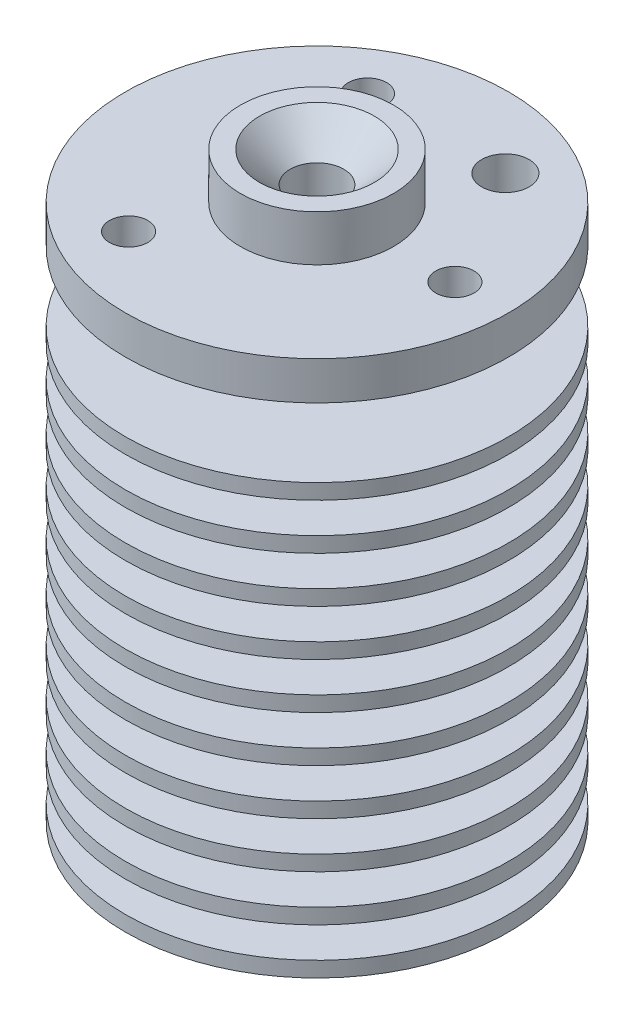
ISO-10303-21;
HEADER;
FILE_DESCRIPTION(('STEP AP214'),'2;1');
FILE_NAME('part.step','',(''),(''),'','','');
FILE_SCHEMA(('AUTOMOTIVE_DESIGN { 1 0 10303 214 1 1 1 1 }'));
ENDSEC;
DATA;
#1=APPLICATION_CONTEXT('core data for automotive mechanical design processes');
#2=APPLICATION_PROTOCOL_DEFINITION('international standard','automotive_design',2000,#1);
#3=PRODUCT_CONTEXT('',#1,'mechanical');
#4=PRODUCT('Part','Part','',(#3));
#5=PRODUCT_RELATED_PRODUCT_CATEGORY('part','',(#4));
#6=PRODUCT_DEFINITION_FORMATION('','',#4);
#7=PRODUCT_DEFINITION_CONTEXT('part definition',#1,'design');
#8=PRODUCT_DEFINITION('design','',#6,#7);
#9=PRODUCT_DEFINITION_SHAPE('','',#8);
#10=(LENGTH_UNIT() NAMED_UNIT(*) SI_UNIT(.MILLI.,.METRE.));
#11=(NAMED_UNIT(*) PLANE_ANGLE_UNIT() SI_UNIT($,.RADIAN.));
#12=(NAMED_UNIT(*) SI_UNIT($,.STERADIAN.) SOLID_ANGLE_UNIT());
#13=UNCERTAINTY_MEASURE_WITH_UNIT(LENGTH_MEASURE(1.E-05),#10,'distance_accuracy_value','');
#14=(GEOMETRIC_REPRESENTATION_CONTEXT(3) GLOBAL_UNCERTAINTY_ASSIGNED_CONTEXT((#13)) GLOBAL_UNIT_ASSIGNED_CONTEXT((#10,
#11,#12)) REPRESENTATION_CONTEXT('',''));
#15=CARTESIAN_POINT('',(0.,0.,0.));
#16=DIRECTION('',(0.,0.,1.));
#17=DIRECTION('',(1.,0.,0.));
#18=AXIS2_PLACEMENT_3D('',#15,#16,#17);
#19=CARTESIAN_POINT('',(0.,9.99999999999999,-12.5));
#20=DIRECTION('',(0.,-1.,0.));
#21=DIRECTION('',(0.,0.,-1.));
#22=AXIS2_PLACEMENT_3D('',#19,#20,#21);
#23=PLANE('',#22);
#24=CARTESIAN_POINT('',(0.,9.99999999999999,0.));
#25=DIRECTION('',(0.,1.,0.));
#26=DIRECTION('',(0.,0.,1.));
#27=AXIS2_PLACEMENT_3D('',#24,#25,#26);
#28=CIRCLE('',#27,12.5);
#29=CARTESIAN_POINT('',(0.,9.99999999999999,12.5));
#30=VERTEX_POINT('',#29);
#31=EDGE_CURVE('E98',#30,#30,#28,.T.);
#32=ORIENTED_EDGE('',*,*,#31,.F.);
#33=EDGE_LOOP('',(#32));
#34=FACE_BOUND('',#33,.T.);
#35=CARTESIAN_POINT('',(0.,9.99999999999999,0.));
#36=DIRECTION('',(0.,-1.,0.));
#37=DIRECTION('',(0.,0.,-1.));
#38=AXIS2_PLACEMENT_3D('',#35,#36,#37);
#39=CIRCLE('',#38,5.);
#40=CARTESIAN_POINT('',(0.,9.99999999999999,-5.));
#41=VERTEX_POINT('',#40);
#42=EDGE_CURVE('E364',#41,#41,#39,.T.);
#43=ORIENTED_EDGE('',*,*,#42,.F.);
#44=EDGE_LOOP('',(#43));
#45=FACE_BOUND('',#44,.T.);
#46=ADVANCED_FACE('F34',(#34,#45),#23,.T.);
#47=CARTESIAN_POINT('',(0.,1.99999999999999,-3.5));
#48=DIRECTION('',(0.,1.,0.));
#49=DIRECTION('',(0.,0.,1.));
#50=AXIS2_PLACEMENT_3D('',#47,#48,#49);
#51=PLANE('',#50);
#52=CARTESIAN_POINT('',(0.,1.99999999999999,0.));
#53=DIRECTION('',(0.,1.,0.));
#54=DIRECTION('',(0.,0.,1.));
#55=AXIS2_PLACEMENT_3D('',#52,#53,#54);
#56=CIRCLE('',#55,12.5);
#57=CARTESIAN_POINT('',(0.,1.99999999999999,12.5));
#58=VERTEX_POINT('',#57);
#59=EDGE_CURVE('E83',#58,#58,#56,.T.);
#60=ORIENTED_EDGE('',*,*,#59,.T.);
#61=EDGE_LOOP('',(#60));
#62=FACE_BOUND('',#61,.T.);
#63=CARTESIAN_POINT('',(0.,1.99999999999999,0.));
#64=DIRECTION('',(0.,1.,0.));
#65=DIRECTION('',(0.,0.,1.));
#66=AXIS2_PLACEMENT_3D('',#63,#64,#65);
#67=CIRCLE('',#66,5.);
#68=CARTESIAN_POINT('',(0.,1.99999999999999,5.));
#69=VERTEX_POINT('',#68);
#70=EDGE_CURVE('E363',#69,#69,#67,.T.);
#71=ORIENTED_EDGE('',*,*,#70,.F.);
#72=EDGE_LOOP('',(#71));
#73=FACE_BOUND('',#72,.T.);
#74=ADVANCED_FACE('F209',(#62,#73),#51,.T.);
#75=CARTESIAN_POINT('',(0.,0.,0.));
#76=DIRECTION('',(0.,-1.,0.));
#77=DIRECTION('',(0.,0.,-1.));
#78=AXIS2_PLACEMENT_3D('',#75,#76,#77);
#79=CYLINDRICAL_SURFACE('',#78,12.5);
#80=ORIENTED_EDGE('',*,*,#59,.F.);
#81=EDGE_LOOP('',(#80));
#82=FACE_BOUND('',#81,.T.);
#83=CARTESIAN_POINT('',(0.,1.,0.));
#84=DIRECTION('',(0.,-1.,0.));
#85=DIRECTION('',(0.,0.,-1.));
#86=AXIS2_PLACEMENT_3D('',#83,#84,#85);
#87=CIRCLE('',#86,12.5);
#88=CARTESIAN_POINT('',(0.,1.,-12.5));
#89=VERTEX_POINT('',#88);
#90=EDGE_CURVE('E56',#89,#89,#87,.T.);
#91=ORIENTED_EDGE('',*,*,#90,.F.);
#92=EDGE_LOOP('',(#91));
#93=FACE_BOUND('',#92,.T.);
#94=ADVANCED_FACE('F203',(#82,#93),#79,.T.);
#95=CARTESIAN_POINT('',(0.,0.,0.));
#96=DIRECTION('',(0.,-1.,0.));
#97=DIRECTION('',(0.,0.,-1.));
#98=AXIS2_PLACEMENT_3D('',#95,#96,#97);
#99=CYLINDRICAL_SURFACE('',#98,2.5);
#100=CARTESIAN_POINT('',(0.,8.,0.));
#101=DIRECTION('',(0.,-1.,0.));
#102=DIRECTION('',(0.,0.,-1.));
#103=AXIS2_PLACEMENT_3D('',#100,#101,#102);
#104=CIRCLE('',#103,2.5);
#105=CARTESIAN_POINT('',(0.,8.,-2.5));
#106=VERTEX_POINT('',#105);
#107=EDGE_CURVE('E182',#106,#106,#104,.T.);
#108=ORIENTED_EDGE('',*,*,#107,.F.);
#109=EDGE_LOOP('',(#108));
#110=FACE_BOUND('',#109,.T.);
#111=CARTESIAN_POINT('',(0.,1.,0.));
#112=DIRECTION('',(0.,-1.,0.));
#113=DIRECTION('',(0.,0.,-1.));
#114=AXIS2_PLACEMENT_3D('',#111,#112,#113);
#115=CIRCLE('',#114,2.5);
#116=CARTESIAN_POINT('',(0.,1.,-2.5));
#117=VERTEX_POINT('',#116);
#118=EDGE_CURVE('E53',#117,#117,#115,.F.);
#119=ORIENTED_EDGE('',*,*,#118,.F.);
#120=EDGE_LOOP('',(#119));
#121=FACE_BOUND('',#120,.T.);
#122=ADVANCED_FACE('F192',(#110,#121),#99,.F.);
#123=CARTESIAN_POINT('',(-0.8,36.,0.));
#124=DIRECTION('',(0.,-1.,0.));
#125=DIRECTION('',(0.,0.,-1.));
#126=AXIS2_PLACEMENT_3D('',#123,#124,#125);
#127=PLANE('',#126);
#128=CARTESIAN_POINT('',(4.49999999999998,36.,-7.79422863405996));
#129=DIRECTION('',(0.,1.,0.));
#130=DIRECTION('',(0.,0.,1.));
#131=AXIS2_PLACEMENT_3D('',#128,#129,#130);
#132=CIRCLE('',#131,1.55);
#133=CARTESIAN_POINT('',(4.49999999999998,36.,-6.24422863405996));
#134=VERTEX_POINT('',#133);
#135=EDGE_CURVE('E384',#134,#134,#132,.T.);
#136=ORIENTED_EDGE('',*,*,#135,.F.);
#137=EDGE_LOOP('',(#136));
#138=FACE_BOUND('',#137,.T.);
#139=CARTESIAN_POINT('',(-4.5,36.,-7.79422863405995));
#140=DIRECTION('',(0.,1.,0.));
#141=DIRECTION('',(0.,0.,1.));
#142=AXIS2_PLACEMENT_3D('',#139,#140,#141);
#143=CIRCLE('',#142,1.25);
#144=CARTESIAN_POINT('',(-4.5,36.,-6.54422863405995));
#145=VERTEX_POINT('',#144);
#146=EDGE_CURVE('E55',#145,#145,#143,.T.);
#147=ORIENTED_EDGE('',*,*,#146,.F.);
#148=EDGE_LOOP('',(#147));
#149=FACE_BOUND('',#148,.T.);
#150=CARTESIAN_POINT('',(-4.5,36.,7.79422863405995));
#151=DIRECTION('',(0.,1.,0.));
#152=DIRECTION('',(0.,0.,1.));
#153=AXIS2_PLACEMENT_3D('',#150,#151,#152);
#154=CIRCLE('',#153,1.25);
#155=CARTESIAN_POINT('',(-4.5,36.,9.04422863405995));
#156=VERTEX_POINT('',#155);
#157=EDGE_CURVE('E60',#156,#156,#154,.T.);
#158=ORIENTED_EDGE('',*,*,#157,.F.);
#159=EDGE_LOOP('',(#158));
#160=FACE_BOUND('',#159,.T.);
#161=CARTESIAN_POINT('',(9.,36.,0.));
#162=DIRECTION('',(0.,1.,0.));
#163=DIRECTION('',(0.,0.,1.));
#164=AXIS2_PLACEMENT_3D('',#161,#162,#163);
#165=CIRCLE('',#164,1.25);
#166=CARTESIAN_POINT('',(9.,36.,1.25));
#167=VERTEX_POINT('',#166);
#168=EDGE_CURVE('E74',#167,#167,#165,.T.);
#169=ORIENTED_EDGE('',*,*,#168,.F.);
#170=EDGE_LOOP('',(#169));
#171=FACE_BOUND('',#170,.T.);
#172=CARTESIAN_POINT('',(0.,36.,0.));
#173=DIRECTION('',(0.,-1.,0.));
#174=DIRECTION('',(0.,0.,-1.));
#175=AXIS2_PLACEMENT_3D('',#172,#173,#174);
#176=CIRCLE('',#175,12.5);
#177=CARTESIAN_POINT('',(0.,36.,-12.5));
#178=VERTEX_POINT('',#177);
#179=EDGE_CURVE('E179',#178,#178,#176,.T.);
#180=ORIENTED_EDGE('',*,*,#179,.F.);
#181=EDGE_LOOP('',(#180));
#182=FACE_BOUND('',#181,.T.);
#183=CARTESIAN_POINT('',(0.,36.,0.));
#184=DIRECTION('',(0.,-1.,0.));
#185=DIRECTION('',(0.,0.,-1.));
#186=AXIS2_PLACEMENT_3D('',#183,#184,#185);
#187=CIRCLE('',#186,5.);
#188=CARTESIAN_POINT('',(0.,36.,-5.));
#189=VERTEX_POINT('',#188);
#190=EDGE_CURVE('E50',#189,#189,#187,.F.);
#191=ORIENTED_EDGE('',*,*,#190,.F.);
#192=EDGE_LOOP('',(#191));
#193=FACE_BOUND('',#192,.T.);
#194=ADVANCED_FACE('F189',(#138,#149,#160,#171,#182,#193),#127,.F.);
#195=CARTESIAN_POINT('',(0.,11.,0.));
#196=DIRECTION('',(0.,1.,0.));
#197=DIRECTION('',(0.,0.,1.));
#198=AXIS2_PLACEMENT_3D('',#195,#196,#197);
#199=CIRCLE('',#198,12.5);
#200=CARTESIAN_POINT('',(0.,11.,12.5));
#201=VERTEX_POINT('',#200);
#202=EDGE_CURVE('E101',#201,#201,#199,.T.);
#203=ORIENTED_EDGE('',*,*,#202,.F.);
#204=EDGE_LOOP('',(#203));
#205=FACE_BOUND('',#204,.T.);
#206=ORIENTED_EDGE('',*,*,#31,.T.);
#207=EDGE_LOOP('',(#206));
#208=FACE_BOUND('',#207,.T.);
#209=ADVANCED_FACE('F191',(#205,#208),#79,.T.);
#210=CARTESIAN_POINT('',(0.,14.,0.));
#211=DIRECTION('',(0.,1.,0.));
#212=DIRECTION('',(0.,0.,1.));
#213=AXIS2_PLACEMENT_3D('',#210,#211,#212);
#214=CIRCLE('',#213,12.5);
#215=CARTESIAN_POINT('',(0.,14.,12.5));
#216=VERTEX_POINT('',#215);
#217=EDGE_CURVE('E113',#216,#216,#214,.T.);
#218=ORIENTED_EDGE('',*,*,#217,.F.);
#219=EDGE_LOOP('',(#218));
#220=FACE_BOUND('',#219,.T.);
#221=CARTESIAN_POINT('',(0.,13.,0.));
#222=DIRECTION('',(0.,1.,0.));
#223=DIRECTION('',(0.,0.,1.));
#224=AXIS2_PLACEMENT_3D('',#221,#222,#223);
#225=CIRCLE('',#224,12.5);
#226=CARTESIAN_POINT('',(0.,13.,12.5));
#227=VERTEX_POINT('',#226);
#228=EDGE_CURVE('E110',#227,#227,#225,.T.);
#229=ORIENTED_EDGE('',*,*,#228,.T.);
#230=EDGE_LOOP('',(#229));
#231=FACE_BOUND('',#230,.T.);
#232=ADVANCED_FACE('F199',(#220,#231),#79,.T.);
#233=CARTESIAN_POINT('',(0.,17.,0.));
#234=DIRECTION('',(0.,1.,0.));
#235=DIRECTION('',(0.,0.,1.));
#236=AXIS2_PLACEMENT_3D('',#233,#234,#235);
#237=CIRCLE('',#236,12.5);
#238=CARTESIAN_POINT('',(0.,17.,12.5));
#239=VERTEX_POINT('',#238);
#240=EDGE_CURVE('E125',#239,#239,#237,.T.);
#241=ORIENTED_EDGE('',*,*,#240,.F.);
#242=EDGE_LOOP('',(#241));
#243=FACE_BOUND('',#242,.T.);
#244=CARTESIAN_POINT('',(0.,16.,0.));
#245=DIRECTION('',(0.,1.,0.));
#246=DIRECTION('',(0.,0.,1.));
#247=AXIS2_PLACEMENT_3D('',#244,#245,#246);
#248=CIRCLE('',#247,12.5);
#249=CARTESIAN_POINT('',(0.,16.,12.5));
#250=VERTEX_POINT('',#249);
#251=EDGE_CURVE('E122',#250,#250,#248,.T.);
#252=ORIENTED_EDGE('',*,*,#251,.T.);
#253=EDGE_LOOP('',(#252));
#254=FACE_BOUND('',#253,.T.);
#255=ADVANCED_FACE('F728',(#243,#254),#79,.T.);
#256=CARTESIAN_POINT('',(0.,20.,0.));
#257=DIRECTION('',(0.,1.,0.));
#258=DIRECTION('',(0.,0.,1.));
#259=AXIS2_PLACEMENT_3D('',#256,#257,#258);
#260=CIRCLE('',#259,12.5);
#261=CARTESIAN_POINT('',(0.,20.,12.5));
#262=VERTEX_POINT('',#261);
#263=EDGE_CURVE('E137',#262,#262,#260,.T.);
#264=ORIENTED_EDGE('',*,*,#263,.F.);
#265=EDGE_LOOP('',(#264));
#266=FACE_BOUND('',#265,.T.);
#267=CARTESIAN_POINT('',(0.,19.,0.));
#268=DIRECTION('',(0.,1.,0.));
#269=DIRECTION('',(0.,0.,1.));
#270=AXIS2_PLACEMENT_3D('',#267,#268,#269);
#271=CIRCLE('',#270,12.5);
#272=CARTESIAN_POINT('',(0.,19.,12.5));
#273=VERTEX_POINT('',#272);
#274=EDGE_CURVE('E134',#273,#273,#271,.T.);
#275=ORIENTED_EDGE('',*,*,#274,.T.);
#276=EDGE_LOOP('',(#275));
#277=FACE_BOUND('',#276,.T.);
#278=ADVANCED_FACE('F736',(#266,#277),#79,.T.);
#279=CARTESIAN_POINT('',(0.,23.,0.));
#280=DIRECTION('',(0.,1.,0.));
#281=DIRECTION('',(0.,0.,1.));
#282=AXIS2_PLACEMENT_3D('',#279,#280,#281);
#283=CIRCLE('',#282,12.5);
#284=CARTESIAN_POINT('',(0.,23.,12.5));
#285=VERTEX_POINT('',#284);
#286=EDGE_CURVE('E149',#285,#285,#283,.T.);
#287=ORIENTED_EDGE('',*,*,#286,.F.);
#288=EDGE_LOOP('',(#287));
#289=FACE_BOUND('',#288,.T.);
#290=CARTESIAN_POINT('',(0.,22.,0.));
#291=DIRECTION('',(0.,1.,0.));
#292=DIRECTION('',(0.,0.,1.));
#293=AXIS2_PLACEMENT_3D('',#290,#291,#292);
#294=CIRCLE('',#293,12.5);
#295=CARTESIAN_POINT('',(0.,22.,12.5));
#296=VERTEX_POINT('',#295);
#297=EDGE_CURVE('E146',#296,#296,#294,.T.);
#298=ORIENTED_EDGE('',*,*,#297,.T.);
#299=EDGE_LOOP('',(#298));
#300=FACE_BOUND('',#299,.T.);
#301=ADVANCED_FACE('F744',(#289,#300),#79,.T.);
#302=CARTESIAN_POINT('',(0.,26.,0.));
#303=DIRECTION('',(0.,1.,0.));
#304=DIRECTION('',(0.,0.,1.));
#305=AXIS2_PLACEMENT_3D('',#302,#303,#304);
#306=CIRCLE('',#305,12.5);
#307=CARTESIAN_POINT('',(0.,26.,12.5));
#308=VERTEX_POINT('',#307);
#309=EDGE_CURVE('E161',#308,#308,#306,.T.);
#310=ORIENTED_EDGE('',*,*,#309,.F.);
#311=EDGE_LOOP('',(#310));
#312=FACE_BOUND('',#311,.T.);
#313=CARTESIAN_POINT('',(0.,25.,0.));
#314=DIRECTION('',(0.,1.,0.));
#315=DIRECTION('',(0.,0.,1.));
#316=AXIS2_PLACEMENT_3D('',#313,#314,#315);
#317=CIRCLE('',#316,12.5);
#318=CARTESIAN_POINT('',(0.,25.,12.5));
#319=VERTEX_POINT('',#318);
#320=EDGE_CURVE('E158',#319,#319,#317,.T.);
#321=ORIENTED_EDGE('',*,*,#320,.T.);
#322=EDGE_LOOP('',(#321));
#323=FACE_BOUND('',#322,.T.);
#324=ADVANCED_FACE('F313',(#312,#323),#79,.T.);
#325=CARTESIAN_POINT('',(0.,29.,0.));
#326=DIRECTION('',(0.,1.,0.));
#327=DIRECTION('',(0.,0.,1.));
#328=AXIS2_PLACEMENT_3D('',#325,#326,#327);
#329=CIRCLE('',#328,12.5);
#330=CARTESIAN_POINT('',(0.,29.,12.5));
#331=VERTEX_POINT('',#330);
#332=EDGE_CURVE('E173',#331,#331,#329,.T.);
#333=ORIENTED_EDGE('',*,*,#332,.F.);
#334=EDGE_LOOP('',(#333));
#335=FACE_BOUND('',#334,.T.);
#336=CARTESIAN_POINT('',(0.,28.,0.));
#337=DIRECTION('',(0.,1.,0.));
#338=DIRECTION('',(0.,0.,1.));
#339=AXIS2_PLACEMENT_3D('',#336,#337,#338);
#340=CIRCLE('',#339,12.5);
#341=CARTESIAN_POINT('',(0.,28.,12.5));
#342=VERTEX_POINT('',#341);
#343=EDGE_CURVE('E170',#342,#342,#340,.T.);
#344=ORIENTED_EDGE('',*,*,#343,.T.);
#345=EDGE_LOOP('',(#344));
#346=FACE_BOUND('',#345,.T.);
#347=ADVANCED_FACE('F306',(#335,#346),#79,.T.);
#348=ORIENTED_EDGE('',*,*,#179,.T.);
#349=EDGE_LOOP('',(#348));
#350=FACE_BOUND('',#349,.T.);
#351=CARTESIAN_POINT('',(0.,33.5,0.));
#352=DIRECTION('',(0.,-1.,0.));
#353=DIRECTION('',(0.,0.,-1.));
#354=AXIS2_PLACEMENT_3D('',#351,#352,#353);
#355=CIRCLE('',#354,12.5);
#356=CARTESIAN_POINT('',(0.,33.5,-12.5));
#357=VERTEX_POINT('',#356);
#358=EDGE_CURVE('E367',#357,#357,#355,.T.);
#359=ORIENTED_EDGE('',*,*,#358,.F.);
#360=EDGE_LOOP('',(#359));
#361=FACE_BOUND('',#360,.T.);
#362=ADVANCED_FACE('F304',(#350,#361),#79,.T.);
#363=CARTESIAN_POINT('',(-2.5,8.,0.));
#364=DIRECTION('',(0.,1.,0.));
#365=DIRECTION('',(0.,0.,1.));
#366=AXIS2_PLACEMENT_3D('',#363,#364,#365);
#367=PLANE('',#366);
#368=CARTESIAN_POINT('',(0.,8.,0.));
#369=DIRECTION('',(0.,1.,0.));
#370=DIRECTION('',(0.,0.,1.));
#371=AXIS2_PLACEMENT_3D('',#368,#369,#370);
#372=CIRCLE('',#371,1.75);
#373=CARTESIAN_POINT('',(0.,8.,1.75));
#374=VERTEX_POINT('',#373);
#375=EDGE_CURVE('E77',#374,#374,#372,.T.);
#376=ORIENTED_EDGE('',*,*,#375,.T.);
#377=EDGE_LOOP('',(#376));
#378=FACE_BOUND('',#377,.T.);
#379=ORIENTED_EDGE('',*,*,#107,.T.);
#380=EDGE_LOOP('',(#379));
#381=FACE_BOUND('',#380,.T.);
#382=ADVANCED_FACE('F302',(#378,#381),#367,.F.);
#383=CARTESIAN_POINT('',(0.,36.,0.));
#384=DIRECTION('',(0.,1.,0.));
#385=DIRECTION('',(0.,0.,1.));
#386=AXIS2_PLACEMENT_3D('',#383,#384,#385);
#387=CYLINDRICAL_SURFACE('',#386,3.5);
#388=CARTESIAN_POINT('',(0.,33.5,0.));
#389=DIRECTION('',(0.,-1.,0.));
#390=DIRECTION('',(0.,0.,-1.));
#391=AXIS2_PLACEMENT_3D('',#388,#389,#390);
#392=CIRCLE('',#391,3.5);
#393=CARTESIAN_POINT('',(0.,33.5,-3.5));
#394=VERTEX_POINT('',#393);
#395=EDGE_CURVE('E10',#394,#394,#392,.F.);
#396=ORIENTED_EDGE('',*,*,#395,.F.);
#397=EDGE_LOOP('',(#396));
#398=FACE_BOUND('',#397,.T.);
#399=CARTESIAN_POINT('',(0.,29.,0.));
#400=DIRECTION('',(0.,1.,0.));
#401=DIRECTION('',(0.,0.,1.));
#402=AXIS2_PLACEMENT_3D('',#399,#400,#401);
#403=CIRCLE('',#402,3.5);
#404=CARTESIAN_POINT('',(0.,29.,3.5));
#405=VERTEX_POINT('',#404);
#406=EDGE_CURVE('E176',#405,#405,#403,.T.);
#407=ORIENTED_EDGE('',*,*,#406,.T.);
#408=EDGE_LOOP('',(#407));
#409=FACE_BOUND('',#408,.T.);
#410=ADVANCED_FACE('F299',(#398,#409),#387,.T.);
#411=CARTESIAN_POINT('',(0.,29.,-3.5));
#412=DIRECTION('',(0.,1.,0.));
#413=DIRECTION('',(0.,0.,1.));
#414=AXIS2_PLACEMENT_3D('',#411,#412,#413);
#415=PLANE('',#414);
#416=ORIENTED_EDGE('',*,*,#332,.T.);
#417=EDGE_LOOP('',(#416));
#418=FACE_BOUND('',#417,.T.);
#419=ORIENTED_EDGE('',*,*,#406,.F.);
#420=EDGE_LOOP('',(#419));
#421=FACE_BOUND('',#420,.T.);
#422=ADVANCED_FACE('F295',(#418,#421),#415,.T.);
#423=CARTESIAN_POINT('',(0.,28.,-12.5));
#424=DIRECTION('',(0.,-1.,0.));
#425=DIRECTION('',(0.,0.,-1.));
#426=AXIS2_PLACEMENT_3D('',#423,#424,#425);
#427=PLANE('',#426);
#428=CARTESIAN_POINT('',(0.,28.,0.));
#429=DIRECTION('',(0.,1.,0.));
#430=DIRECTION('',(0.,0.,1.));
#431=AXIS2_PLACEMENT_3D('',#428,#429,#430);
#432=CIRCLE('',#431,3.5);
#433=CARTESIAN_POINT('',(0.,28.,3.5));
#434=VERTEX_POINT('',#433);
#435=EDGE_CURVE('E167',#434,#434,#432,.T.);
#436=ORIENTED_EDGE('',*,*,#435,.T.);
#437=EDGE_LOOP('',(#436));
#438=FACE_BOUND('',#437,.T.);
#439=ORIENTED_EDGE('',*,*,#343,.F.);
#440=EDGE_LOOP('',(#439));
#441=FACE_BOUND('',#440,.T.);
#442=ADVANCED_FACE('F291',(#438,#441),#427,.T.);
#443=CARTESIAN_POINT('',(0.,30.,0.));
#444=DIRECTION('',(0.,1.,0.));
#445=DIRECTION('',(0.,0.,1.));
#446=AXIS2_PLACEMENT_3D('',#443,#444,#445);
#447=CYLINDRICAL_SURFACE('',#446,3.5);
#448=CARTESIAN_POINT('',(0.,26.,0.));
#449=DIRECTION('',(0.,1.,0.));
#450=DIRECTION('',(0.,0.,1.));
#451=AXIS2_PLACEMENT_3D('',#448,#449,#450);
#452=CIRCLE('',#451,3.5);
#453=CARTESIAN_POINT('',(0.,26.,3.5));
#454=VERTEX_POINT('',#453);
#455=EDGE_CURVE('E164',#454,#454,#452,.T.);
#456=ORIENTED_EDGE('',*,*,#455,.T.);
#457=EDGE_LOOP('',(#456));
#458=FACE_BOUND('',#457,.T.);
#459=ORIENTED_EDGE('',*,*,#435,.F.);
#460=EDGE_LOOP('',(#459));
#461=FACE_BOUND('',#460,.T.);
#462=ADVANCED_FACE('F287',(#458,#461),#447,.T.);
#463=CARTESIAN_POINT('',(0.,26.,-3.5));
#464=DIRECTION('',(0.,1.,0.));
#465=DIRECTION('',(0.,0.,1.));
#466=AXIS2_PLACEMENT_3D('',#463,#464,#465);
#467=PLANE('',#466);
#468=ORIENTED_EDGE('',*,*,#309,.T.);
#469=EDGE_LOOP('',(#468));
#470=FACE_BOUND('',#469,.T.);
#471=ORIENTED_EDGE('',*,*,#455,.F.);
#472=EDGE_LOOP('',(#471));
#473=FACE_BOUND('',#472,.T.);
#474=ADVANCED_FACE('F283',(#470,#473),#467,.T.);
#475=CARTESIAN_POINT('',(0.,25.,-12.5));
#476=DIRECTION('',(0.,-1.,0.));
#477=DIRECTION('',(0.,0.,-1.));
#478=AXIS2_PLACEMENT_3D('',#475,#476,#477);
#479=PLANE('',#478);
#480=CARTESIAN_POINT('',(0.,25.,0.));
#481=DIRECTION('',(0.,1.,0.));
#482=DIRECTION('',(0.,0.,1.));
#483=AXIS2_PLACEMENT_3D('',#480,#481,#482);
#484=CIRCLE('',#483,3.5);
#485=CARTESIAN_POINT('',(0.,25.,3.5));
#486=VERTEX_POINT('',#485);
#487=EDGE_CURVE('E155',#486,#486,#484,.T.);
#488=ORIENTED_EDGE('',*,*,#487,.T.);
#489=EDGE_LOOP('',(#488));
#490=FACE_BOUND('',#489,.T.);
#491=ORIENTED_EDGE('',*,*,#320,.F.);
#492=EDGE_LOOP('',(#491));
#493=FACE_BOUND('',#492,.T.);
#494=ADVANCED_FACE('F279',(#490,#493),#479,.T.);
#495=CARTESIAN_POINT('',(0.,27.,0.));
#496=DIRECTION('',(0.,1.,0.));
#497=DIRECTION('',(0.,0.,1.));
#498=AXIS2_PLACEMENT_3D('',#495,#496,#497);
#499=CYLINDRICAL_SURFACE('',#498,3.5);
#500=CARTESIAN_POINT('',(0.,23.,0.));
#501=DIRECTION('',(0.,1.,0.));
#502=DIRECTION('',(0.,0.,1.));
#503=AXIS2_PLACEMENT_3D('',#500,#501,#502);
#504=CIRCLE('',#503,3.5);
#505=CARTESIAN_POINT('',(0.,23.,3.5));
#506=VERTEX_POINT('',#505);
#507=EDGE_CURVE('E152',#506,#506,#504,.T.);
#508=ORIENTED_EDGE('',*,*,#507,.T.);
#509=EDGE_LOOP('',(#508));
#510=FACE_BOUND('',#509,.T.);
#511=ORIENTED_EDGE('',*,*,#487,.F.);
#512=EDGE_LOOP('',(#511));
#513=FACE_BOUND('',#512,.T.);
#514=ADVANCED_FACE('F275',(#510,#513),#499,.T.);
#515=CARTESIAN_POINT('',(0.,23.,-3.5));
#516=DIRECTION('',(0.,1.,0.));
#517=DIRECTION('',(0.,0.,1.));
#518=AXIS2_PLACEMENT_3D('',#515,#516,#517);
#519=PLANE('',#518);
#520=ORIENTED_EDGE('',*,*,#286,.T.);
#521=EDGE_LOOP('',(#520));
#522=FACE_BOUND('',#521,.T.);
#523=ORIENTED_EDGE('',*,*,#507,.F.);
#524=EDGE_LOOP('',(#523));
#525=FACE_BOUND('',#524,.T.);
#526=ADVANCED_FACE('F271',(#522,#525),#519,.T.);
#527=CARTESIAN_POINT('',(0.,22.,-12.5));
#528=DIRECTION('',(0.,-1.,0.));
#529=DIRECTION('',(0.,0.,-1.));
#530=AXIS2_PLACEMENT_3D('',#527,#528,#529);
#531=PLANE('',#530);
#532=CARTESIAN_POINT('',(0.,22.,0.));
#533=DIRECTION('',(0.,1.,0.));
#534=DIRECTION('',(0.,0.,1.));
#535=AXIS2_PLACEMENT_3D('',#532,#533,#534);
#536=CIRCLE('',#535,3.5);
#537=CARTESIAN_POINT('',(0.,22.,3.5));
#538=VERTEX_POINT('',#537);
#539=EDGE_CURVE('E143',#538,#538,#536,.T.);
#540=ORIENTED_EDGE('',*,*,#539,.T.);
#541=EDGE_LOOP('',(#540));
#542=FACE_BOUND('',#541,.T.);
#543=ORIENTED_EDGE('',*,*,#297,.F.);
#544=EDGE_LOOP('',(#543));
#545=FACE_BOUND('',#544,.T.);
#546=ADVANCED_FACE('F267',(#542,#545),#531,.T.);
#547=CARTESIAN_POINT('',(0.,24.,0.));
#548=DIRECTION('',(0.,1.,0.));
#549=DIRECTION('',(0.,0.,1.));
#550=AXIS2_PLACEMENT_3D('',#547,#548,#549);
#551=CYLINDRICAL_SURFACE('',#550,3.5);
#552=CARTESIAN_POINT('',(0.,20.,0.));
#553=DIRECTION('',(0.,1.,0.));
#554=DIRECTION('',(0.,0.,1.));
#555=AXIS2_PLACEMENT_3D('',#552,#553,#554);
#556=CIRCLE('',#555,3.5);
#557=CARTESIAN_POINT('',(0.,20.,3.5));
#558=VERTEX_POINT('',#557);
#559=EDGE_CURVE('E140',#558,#558,#556,.T.);
#560=ORIENTED_EDGE('',*,*,#559,.T.);
#561=EDGE_LOOP('',(#560));
#562=FACE_BOUND('',#561,.T.);
#563=ORIENTED_EDGE('',*,*,#539,.F.);
#564=EDGE_LOOP('',(#563));
#565=FACE_BOUND('',#564,.T.);
#566=ADVANCED_FACE('F263',(#562,#565),#551,.T.);
#567=CARTESIAN_POINT('',(0.,20.,-3.5));
#568=DIRECTION('',(0.,1.,0.));
#569=DIRECTION('',(0.,0.,1.));
#570=AXIS2_PLACEMENT_3D('',#567,#568,#569);
#571=PLANE('',#570);
#572=ORIENTED_EDGE('',*,*,#263,.T.);
#573=EDGE_LOOP('',(#572));
#574=FACE_BOUND('',#573,.T.);
#575=ORIENTED_EDGE('',*,*,#559,.F.);
#576=EDGE_LOOP('',(#575));
#577=FACE_BOUND('',#576,.T.);
#578=ADVANCED_FACE('F259',(#574,#577),#571,.T.);
#579=CARTESIAN_POINT('',(0.,19.,-12.5));
#580=DIRECTION('',(0.,-1.,0.));
#581=DIRECTION('',(0.,0.,-1.));
#582=AXIS2_PLACEMENT_3D('',#579,#580,#581);
#583=PLANE('',#582);
#584=CARTESIAN_POINT('',(0.,19.,0.));
#585=DIRECTION('',(0.,1.,0.));
#586=DIRECTION('',(0.,0.,1.));
#587=AXIS2_PLACEMENT_3D('',#584,#585,#586);
#588=CIRCLE('',#587,3.5);
#589=CARTESIAN_POINT('',(0.,19.,3.5));
#590=VERTEX_POINT('',#589);
#591=EDGE_CURVE('E131',#590,#590,#588,.T.);
#592=ORIENTED_EDGE('',*,*,#591,.T.);
#593=EDGE_LOOP('',(#592));
#594=FACE_BOUND('',#593,.T.);
#595=ORIENTED_EDGE('',*,*,#274,.F.);
#596=EDGE_LOOP('',(#595));
#597=FACE_BOUND('',#596,.T.);
#598=ADVANCED_FACE('F255',(#594,#597),#583,.T.);
#599=CARTESIAN_POINT('',(0.,21.,0.));
#600=DIRECTION('',(0.,1.,0.));
#601=DIRECTION('',(0.,0.,1.));
#602=AXIS2_PLACEMENT_3D('',#599,#600,#601);
#603=CYLINDRICAL_SURFACE('',#602,3.5);
#604=CARTESIAN_POINT('',(0.,17.,0.));
#605=DIRECTION('',(0.,1.,0.));
#606=DIRECTION('',(0.,0.,1.));
#607=AXIS2_PLACEMENT_3D('',#604,#605,#606);
#608=CIRCLE('',#607,3.5);
#609=CARTESIAN_POINT('',(0.,17.,3.5));
#610=VERTEX_POINT('',#609);
#611=EDGE_CURVE('E128',#610,#610,#608,.T.);
#612=ORIENTED_EDGE('',*,*,#611,.T.);
#613=EDGE_LOOP('',(#612));
#614=FACE_BOUND('',#613,.T.);
#615=ORIENTED_EDGE('',*,*,#591,.F.);
#616=EDGE_LOOP('',(#615));
#617=FACE_BOUND('',#616,.T.);
#618=ADVANCED_FACE('F251',(#614,#617),#603,.T.);
#619=CARTESIAN_POINT('',(0.,17.,-3.5));
#620=DIRECTION('',(0.,1.,0.));
#621=DIRECTION('',(0.,0.,1.));
#622=AXIS2_PLACEMENT_3D('',#619,#620,#621);
#623=PLANE('',#622);
#624=ORIENTED_EDGE('',*,*,#240,.T.);
#625=EDGE_LOOP('',(#624));
#626=FACE_BOUND('',#625,.T.);
#627=ORIENTED_EDGE('',*,*,#611,.F.);
#628=EDGE_LOOP('',(#627));
#629=FACE_BOUND('',#628,.T.);
#630=ADVANCED_FACE('F247',(#626,#629),#623,.T.);
#631=CARTESIAN_POINT('',(0.,16.,-12.5));
#632=DIRECTION('',(0.,-1.,0.));
#633=DIRECTION('',(0.,0.,-1.));
#634=AXIS2_PLACEMENT_3D('',#631,#632,#633);
#635=PLANE('',#634);
#636=CARTESIAN_POINT('',(0.,16.,0.));
#637=DIRECTION('',(0.,1.,0.));
#638=DIRECTION('',(0.,0.,1.));
#639=AXIS2_PLACEMENT_3D('',#636,#637,#638);
#640=CIRCLE('',#639,3.5);
#641=CARTESIAN_POINT('',(0.,16.,3.5));
#642=VERTEX_POINT('',#641);
#643=EDGE_CURVE('E119',#642,#642,#640,.T.);
#644=ORIENTED_EDGE('',*,*,#643,.T.);
#645=EDGE_LOOP('',(#644));
#646=FACE_BOUND('',#645,.T.);
#647=ORIENTED_EDGE('',*,*,#251,.F.);
#648=EDGE_LOOP('',(#647));
#649=FACE_BOUND('',#648,.T.);
#650=ADVANCED_FACE('F243',(#646,#649),#635,.T.);
#651=CARTESIAN_POINT('',(0.,18.,0.));
#652=DIRECTION('',(0.,1.,0.));
#653=DIRECTION('',(0.,0.,1.));
#654=AXIS2_PLACEMENT_3D('',#651,#652,#653);
#655=CYLINDRICAL_SURFACE('',#654,3.5);
#656=CARTESIAN_POINT('',(0.,14.,0.));
#657=DIRECTION('',(0.,1.,0.));
#658=DIRECTION('',(0.,0.,1.));
#659=AXIS2_PLACEMENT_3D('',#656,#657,#658);
#660=CIRCLE('',#659,3.5);
#661=CARTESIAN_POINT('',(0.,14.,3.5));
#662=VERTEX_POINT('',#661);
#663=EDGE_CURVE('E116',#662,#662,#660,.T.);
#664=ORIENTED_EDGE('',*,*,#663,.T.);
#665=EDGE_LOOP('',(#664));
#666=FACE_BOUND('',#665,.T.);
#667=ORIENTED_EDGE('',*,*,#643,.F.);
#668=EDGE_LOOP('',(#667));
#669=FACE_BOUND('',#668,.T.);
#670=ADVANCED_FACE('F239',(#666,#669),#655,.T.);
#671=CARTESIAN_POINT('',(0.,14.,-3.5));
#672=DIRECTION('',(0.,1.,0.));
#673=DIRECTION('',(0.,0.,1.));
#674=AXIS2_PLACEMENT_3D('',#671,#672,#673);
#675=PLANE('',#674);
#676=ORIENTED_EDGE('',*,*,#217,.T.);
#677=EDGE_LOOP('',(#676));
#678=FACE_BOUND('',#677,.T.);
#679=ORIENTED_EDGE('',*,*,#663,.F.);
#680=EDGE_LOOP('',(#679));
#681=FACE_BOUND('',#680,.T.);
#682=ADVANCED_FACE('F235',(#678,#681),#675,.T.);
#683=CARTESIAN_POINT('',(0.,13.,-12.5));
#684=DIRECTION('',(0.,-1.,0.));
#685=DIRECTION('',(0.,0.,-1.));
#686=AXIS2_PLACEMENT_3D('',#683,#684,#685);
#687=PLANE('',#686);
#688=CARTESIAN_POINT('',(0.,13.,0.));
#689=DIRECTION('',(0.,1.,0.));
#690=DIRECTION('',(0.,0.,1.));
#691=AXIS2_PLACEMENT_3D('',#688,#689,#690);
#692=CIRCLE('',#691,3.5);
#693=CARTESIAN_POINT('',(0.,13.,3.5));
#694=VERTEX_POINT('',#693);
#695=EDGE_CURVE('E107',#694,#694,#692,.T.);
#696=ORIENTED_EDGE('',*,*,#695,.T.);
#697=EDGE_LOOP('',(#696));
#698=FACE_BOUND('',#697,.T.);
#699=ORIENTED_EDGE('',*,*,#228,.F.);
#700=EDGE_LOOP('',(#699));
#701=FACE_BOUND('',#700,.T.);
#702=ADVANCED_FACE('F231',(#698,#701),#687,.T.);
#703=CARTESIAN_POINT('',(0.,15.,0.));
#704=DIRECTION('',(0.,1.,0.));
#705=DIRECTION('',(0.,0.,1.));
#706=AXIS2_PLACEMENT_3D('',#703,#704,#705);
#707=CYLINDRICAL_SURFACE('',#706,3.5);
#708=CARTESIAN_POINT('',(0.,11.,0.));
#709=DIRECTION('',(0.,1.,0.));
#710=DIRECTION('',(0.,0.,1.));
#711=AXIS2_PLACEMENT_3D('',#708,#709,#710);
#712=CIRCLE('',#711,3.5);
#713=CARTESIAN_POINT('',(0.,11.,3.5));
#714=VERTEX_POINT('',#713);
#715=EDGE_CURVE('E104',#714,#714,#712,.T.);
#716=ORIENTED_EDGE('',*,*,#715,.T.);
#717=EDGE_LOOP('',(#716));
#718=FACE_BOUND('',#717,.T.);
#719=ORIENTED_EDGE('',*,*,#695,.F.);
#720=EDGE_LOOP('',(#719));
#721=FACE_BOUND('',#720,.T.);
#722=ADVANCED_FACE('F227',(#718,#721),#707,.T.);
#723=CARTESIAN_POINT('',(0.,11.,-3.5));
#724=DIRECTION('',(0.,1.,0.));
#725=DIRECTION('',(0.,0.,1.));
#726=AXIS2_PLACEMENT_3D('',#723,#724,#725);
#727=PLANE('',#726);
#728=ORIENTED_EDGE('',*,*,#202,.T.);
#729=EDGE_LOOP('',(#728));
#730=FACE_BOUND('',#729,.T.);
#731=ORIENTED_EDGE('',*,*,#715,.F.);
#732=EDGE_LOOP('',(#731));
#733=FACE_BOUND('',#732,.T.);
#734=ADVANCED_FACE('F223',(#730,#733),#727,.T.);
#735=CARTESIAN_POINT('',(0.,39.,0.));
#736=DIRECTION('',(0.,1.,0.));
#737=DIRECTION('',(0.,0.,1.));
#738=AXIS2_PLACEMENT_3D('',#735,#736,#737);
#739=PLANE('',#738);
#740=CARTESIAN_POINT('',(0.,39.,0.));
#741=DIRECTION('',(0.,1.,0.));
#742=DIRECTION('',(0.,0.,1.));
#743=AXIS2_PLACEMENT_3D('',#740,#741,#742);
#744=CIRCLE('',#743,3.75);
#745=CARTESIAN_POINT('',(0.,39.,3.75));
#746=VERTEX_POINT('',#745);
#747=EDGE_CURVE('E41',#746,#746,#744,.F.);
#748=ORIENTED_EDGE('',*,*,#747,.T.);
#749=EDGE_LOOP('',(#748));
#750=FACE_BOUND('',#749,.T.);
#751=CARTESIAN_POINT('',(0.,39.,0.));
#752=DIRECTION('',(0.,1.,0.));
#753=DIRECTION('',(0.,0.,1.));
#754=AXIS2_PLACEMENT_3D('',#751,#752,#753);
#755=CIRCLE('',#754,5.);
#756=CARTESIAN_POINT('',(0.,39.,5.));
#757=VERTEX_POINT('',#756);
#758=EDGE_CURVE('E80',#757,#757,#755,.T.);
#759=ORIENTED_EDGE('',*,*,#758,.T.);
#760=EDGE_LOOP('',(#759));
#761=FACE_BOUND('',#760,.T.);
#762=ADVANCED_FACE('F226',(#750,#761),#739,.T.);
#763=CARTESIAN_POINT('',(0.,39.,0.));
#764=DIRECTION('',(0.,-1.,0.));
#765=DIRECTION('',(0.,0.,-1.));
#766=AXIS2_PLACEMENT_3D('',#763,#764,#765);
#767=CYLINDRICAL_SURFACE('',#766,5.);
#768=ORIENTED_EDGE('',*,*,#758,.F.);
#769=EDGE_LOOP('',(#768));
#770=FACE_BOUND('',#769,.T.);
#771=ORIENTED_EDGE('',*,*,#190,.T.);
#772=EDGE_LOOP('',(#771));
#773=FACE_BOUND('',#772,.T.);
#774=ADVANCED_FACE('F187',(#770,#773),#767,.T.);
#775=CARTESIAN_POINT('',(0.,0.,0.));
#776=DIRECTION('',(0.,1.,0.));
#777=DIRECTION('',(0.,0.,1.));
#778=AXIS2_PLACEMENT_3D('',#775,#776,#777);
#779=CYLINDRICAL_SURFACE('',#778,1.75);
#780=CARTESIAN_POINT('',(0.,37.,0.));
#781=DIRECTION('',(0.,1.,0.));
#782=DIRECTION('',(0.,0.,1.));
#783=AXIS2_PLACEMENT_3D('',#780,#781,#782);
#784=CIRCLE('',#783,1.75);
#785=CARTESIAN_POINT('',(0.,37.,1.75));
#786=VERTEX_POINT('',#785);
#787=EDGE_CURVE('E45',#786,#786,#784,.T.);
#788=ORIENTED_EDGE('',*,*,#787,.T.);
#789=EDGE_LOOP('',(#788));
#790=FACE_BOUND('',#789,.T.);
#791=ORIENTED_EDGE('',*,*,#375,.F.);
#792=EDGE_LOOP('',(#791));
#793=FACE_BOUND('',#792,.T.);
#794=ADVANCED_FACE('F424',(#790,#793),#779,.F.);
#795=CARTESIAN_POINT('',(0.,37.,0.));
#796=DIRECTION('',(0.,1.,0.));
#797=DIRECTION('',(0.,0.,1.));
#798=AXIS2_PLACEMENT_3D('',#795,#796,#797);
#799=CONICAL_SURFACE('',#798,1.75,0.78539816339745);
#800=ORIENTED_EDGE('',*,*,#747,.F.);
#801=EDGE_LOOP('',(#800));
#802=FACE_BOUND('',#801,.T.);
#803=ORIENTED_EDGE('',*,*,#787,.F.);
#804=EDGE_LOOP('',(#803));
#805=FACE_BOUND('',#804,.T.);
#806=ADVANCED_FACE('F36',(#802,#805),#799,.F.);
#807=CARTESIAN_POINT('',(9.,34.,0.));
#808=DIRECTION('',(0.,1.,0.));
#809=DIRECTION('',(0.,0.,1.));
#810=AXIS2_PLACEMENT_3D('',#807,#808,#809);
#811=CYLINDRICAL_SURFACE('',#810,1.25);
#812=ORIENTED_EDGE('',*,*,#168,.T.);
#813=EDGE_LOOP('',(#812));
#814=FACE_BOUND('',#813,.T.);
#815=CARTESIAN_POINT('',(9.,33.5,0.));
#816=DIRECTION('',(0.,-1.,0.));
#817=DIRECTION('',(0.,0.,-1.));
#818=AXIS2_PLACEMENT_3D('',#815,#816,#817);
#819=CIRCLE('',#818,1.25);
#820=CARTESIAN_POINT('',(9.,33.5,-1.25));
#821=VERTEX_POINT('',#820);
#822=EDGE_CURVE('E372',#821,#821,#819,.T.);
#823=ORIENTED_EDGE('',*,*,#822,.T.);
#824=EDGE_LOOP('',(#823));
#825=FACE_BOUND('',#824,.T.);
#826=ADVANCED_FACE('F416',(#814,#825),#811,.F.);
#827=CARTESIAN_POINT('',(-4.5,34.,7.79422863405995));
#828=DIRECTION('',(0.,1.,0.));
#829=DIRECTION('',(0.,0.,1.));
#830=AXIS2_PLACEMENT_3D('',#827,#828,#829);
#831=CYLINDRICAL_SURFACE('',#830,1.25);
#832=ORIENTED_EDGE('',*,*,#157,.T.);
#833=EDGE_LOOP('',(#832));
#834=FACE_BOUND('',#833,.T.);
#835=CARTESIAN_POINT('',(-4.5,33.5,7.79422863405995));
#836=DIRECTION('',(0.,-1.,0.));
#837=DIRECTION('',(0.,0.,-1.));
#838=AXIS2_PLACEMENT_3D('',#835,#836,#837);
#839=CIRCLE('',#838,1.25);
#840=CARTESIAN_POINT('',(-4.5,33.5,6.54422863405995));
#841=VERTEX_POINT('',#840);
#842=EDGE_CURVE('E375',#841,#841,#839,.T.);
#843=ORIENTED_EDGE('',*,*,#842,.T.);
#844=EDGE_LOOP('',(#843));
#845=FACE_BOUND('',#844,.T.);
#846=ADVANCED_FACE('F408',(#834,#845),#831,.F.);
#847=CARTESIAN_POINT('',(-4.5,34.,-7.79422863405995));
#848=DIRECTION('',(0.,1.,0.));
#849=DIRECTION('',(0.,0.,1.));
#850=AXIS2_PLACEMENT_3D('',#847,#848,#849);
#851=CYLINDRICAL_SURFACE('',#850,1.25);
#852=ORIENTED_EDGE('',*,*,#146,.T.);
#853=EDGE_LOOP('',(#852));
#854=FACE_BOUND('',#853,.T.);
#855=CARTESIAN_POINT('',(-4.5,33.5,-7.79422863405995));
#856=DIRECTION('',(0.,-1.,0.));
#857=DIRECTION('',(0.,0.,-1.));
#858=AXIS2_PLACEMENT_3D('',#855,#856,#857);
#859=CIRCLE('',#858,1.25);
#860=CARTESIAN_POINT('',(-4.5,33.5,-9.04422863405995));
#861=VERTEX_POINT('',#860);
#862=EDGE_CURVE('E378',#861,#861,#859,.T.);
#863=ORIENTED_EDGE('',*,*,#862,.T.);
#864=EDGE_LOOP('',(#863));
#865=FACE_BOUND('',#864,.T.);
#866=ADVANCED_FACE('F405',(#854,#865),#851,.F.);
#867=CARTESIAN_POINT('',(0.,1.,0.));
#868=DIRECTION('',(0.,-1.,0.));
#869=DIRECTION('',(0.,0.,-1.));
#870=AXIS2_PLACEMENT_3D('',#867,#868,#869);
#871=PLANE('',#870);
#872=ORIENTED_EDGE('',*,*,#90,.T.);
#873=EDGE_LOOP('',(#872));
#874=FACE_BOUND('',#873,.T.);
#875=ORIENTED_EDGE('',*,*,#118,.T.);
#876=EDGE_LOOP('',(#875));
#877=FACE_BOUND('',#876,.T.);
#878=ADVANCED_FACE('F407',(#874,#877),#871,.T.);
#879=CARTESIAN_POINT('',(0.,24.1421356237309,0.));
#880=DIRECTION('',(0.,-1.,0.));
#881=DIRECTION('',(0.,0.,-1.));
#882=AXIS2_PLACEMENT_3D('',#879,#880,#881);
#883=CYLINDRICAL_SURFACE('',#882,5.);
#884=CARTESIAN_POINT('',(0.,4.,0.));
#885=DIRECTION('',(0.,-1.,0.));
#886=DIRECTION('',(0.,0.,-1.));
#887=AXIS2_PLACEMENT_3D('',#884,#885,#886);
#888=CIRCLE('',#887,5.);
#889=CARTESIAN_POINT('',(0.,4.,-5.));
#890=VERTEX_POINT('',#889);
#891=EDGE_CURVE('E358',#890,#890,#888,.F.);
#892=ORIENTED_EDGE('',*,*,#891,.F.);
#893=EDGE_LOOP('',(#892));
#894=FACE_BOUND('',#893,.T.);
#895=ORIENTED_EDGE('',*,*,#70,.T.);
#896=EDGE_LOOP('',(#895));
#897=FACE_BOUND('',#896,.T.);
#898=ADVANCED_FACE('F334',(#894,#897),#883,.T.);
#899=CARTESIAN_POINT('',(0.,4.99999999999999,-3.5));
#900=DIRECTION('',(0.,1.,0.));
#901=DIRECTION('',(0.,0.,1.));
#902=AXIS2_PLACEMENT_3D('',#899,#900,#901);
#903=PLANE('',#902);
#904=CARTESIAN_POINT('',(0.,4.99999999999999,0.));
#905=DIRECTION('',(0.,1.,0.));
#906=DIRECTION('',(0.,0.,1.));
#907=AXIS2_PLACEMENT_3D('',#904,#905,#906);
#908=CIRCLE('',#907,12.5);
#909=CARTESIAN_POINT('',(0.,4.99999999999999,12.5));
#910=VERTEX_POINT('',#909);
#911=EDGE_CURVE('E89',#910,#910,#908,.T.);
#912=ORIENTED_EDGE('',*,*,#911,.T.);
#913=EDGE_LOOP('',(#912));
#914=FACE_BOUND('',#913,.T.);
#915=CARTESIAN_POINT('',(0.,4.99999999999999,0.));
#916=DIRECTION('',(0.,1.,0.));
#917=DIRECTION('',(0.,0.,1.));
#918=AXIS2_PLACEMENT_3D('',#915,#916,#917);
#919=CIRCLE('',#918,5.);
#920=CARTESIAN_POINT('',(0.,4.99999999999999,5.));
#921=VERTEX_POINT('',#920);
#922=EDGE_CURVE('E356',#921,#921,#919,.F.);
#923=ORIENTED_EDGE('',*,*,#922,.T.);
#924=EDGE_LOOP('',(#923));
#925=FACE_BOUND('',#924,.T.);
#926=ADVANCED_FACE('F325',(#914,#925),#903,.T.);
#927=ORIENTED_EDGE('',*,*,#911,.F.);
#928=EDGE_LOOP('',(#927));
#929=FACE_BOUND('',#928,.T.);
#930=CARTESIAN_POINT('',(0.,4.,0.));
#931=DIRECTION('',(0.,1.,0.));
#932=DIRECTION('',(0.,0.,1.));
#933=AXIS2_PLACEMENT_3D('',#930,#931,#932);
#934=CIRCLE('',#933,12.5);
#935=CARTESIAN_POINT('',(0.,4.,12.5));
#936=VERTEX_POINT('',#935);
#937=EDGE_CURVE('E86',#936,#936,#934,.T.);
#938=ORIENTED_EDGE('',*,*,#937,.T.);
#939=EDGE_LOOP('',(#938));
#940=FACE_BOUND('',#939,.T.);
#941=ADVANCED_FACE('F318',(#929,#940),#79,.T.);
#942=CARTESIAN_POINT('',(0.,4.,-12.5));
#943=DIRECTION('',(0.,-1.,0.));
#944=DIRECTION('',(0.,0.,-1.));
#945=AXIS2_PLACEMENT_3D('',#942,#943,#944);
#946=PLANE('',#945);
#947=ORIENTED_EDGE('',*,*,#937,.F.);
#948=EDGE_LOOP('',(#947));
#949=FACE_BOUND('',#948,.T.);
#950=ORIENTED_EDGE('',*,*,#891,.T.);
#951=EDGE_LOOP('',(#950));
#952=FACE_BOUND('',#951,.T.);
#953=ADVANCED_FACE('F324',(#949,#952),#946,.T.);
#954=CARTESIAN_POINT('',(0.,7.,0.));
#955=DIRECTION('',(0.,-1.,0.));
#956=DIRECTION('',(0.,0.,-1.));
#957=AXIS2_PLACEMENT_3D('',#954,#955,#956);
#958=CIRCLE('',#957,5.);
#959=CARTESIAN_POINT('',(0.,7.,-5.));
#960=VERTEX_POINT('',#959);
#961=EDGE_CURVE('E68',#960,#960,#958,.F.);
#962=ORIENTED_EDGE('',*,*,#961,.F.);
#963=EDGE_LOOP('',(#962));
#964=FACE_BOUND('',#963,.T.);
#965=ORIENTED_EDGE('',*,*,#922,.F.);
#966=EDGE_LOOP('',(#965));
#967=FACE_BOUND('',#966,.T.);
#968=ADVANCED_FACE('F331',(#964,#967),#883,.T.);
#969=CARTESIAN_POINT('',(0.,7.99999999999999,-3.5));
#970=DIRECTION('',(0.,1.,0.));
#971=DIRECTION('',(0.,0.,1.));
#972=AXIS2_PLACEMENT_3D('',#969,#970,#971);
#973=PLANE('',#972);
#974=CARTESIAN_POINT('',(0.,7.99999999999999,0.));
#975=DIRECTION('',(0.,1.,0.));
#976=DIRECTION('',(0.,0.,1.));
#977=AXIS2_PLACEMENT_3D('',#974,#975,#976);
#978=CIRCLE('',#977,12.5);
#979=CARTESIAN_POINT('',(0.,7.99999999999999,12.5));
#980=VERTEX_POINT('',#979);
#981=EDGE_CURVE('E95',#980,#980,#978,.T.);
#982=ORIENTED_EDGE('',*,*,#981,.T.);
#983=EDGE_LOOP('',(#982));
#984=FACE_BOUND('',#983,.T.);
#985=CARTESIAN_POINT('',(0.,7.99999999999999,0.));
#986=DIRECTION('',(0.,1.,0.));
#987=DIRECTION('',(0.,0.,1.));
#988=AXIS2_PLACEMENT_3D('',#985,#986,#987);
#989=CIRCLE('',#988,5.);
#990=CARTESIAN_POINT('',(0.,7.99999999999999,5.));
#991=VERTEX_POINT('',#990);
#992=EDGE_CURVE('E63',#991,#991,#989,.F.);
#993=ORIENTED_EDGE('',*,*,#992,.T.);
#994=EDGE_LOOP('',(#993));
#995=FACE_BOUND('',#994,.T.);
#996=ADVANCED_FACE('F221',(#984,#995),#973,.T.);
#997=ORIENTED_EDGE('',*,*,#981,.F.);
#998=EDGE_LOOP('',(#997));
#999=FACE_BOUND('',#998,.T.);
#1000=CARTESIAN_POINT('',(0.,7.,0.));
#1001=DIRECTION('',(0.,1.,0.));
#1002=DIRECTION('',(0.,0.,1.));
#1003=AXIS2_PLACEMENT_3D('',#1000,#1001,#1002);
#1004=CIRCLE('',#1003,12.5);
#1005=CARTESIAN_POINT('',(0.,7.,12.5));
#1006=VERTEX_POINT('',#1005);
#1007=EDGE_CURVE('E92',#1006,#1006,#1004,.T.);
#1008=ORIENTED_EDGE('',*,*,#1007,.T.);
#1009=EDGE_LOOP('',(#1008));
#1010=FACE_BOUND('',#1009,.T.);
#1011=ADVANCED_FACE('F202',(#999,#1010),#79,.T.);
#1012=CARTESIAN_POINT('',(0.,7.,-12.5));
#1013=DIRECTION('',(0.,-1.,0.));
#1014=DIRECTION('',(0.,0.,-1.));
#1015=AXIS2_PLACEMENT_3D('',#1012,#1013,#1014);
#1016=PLANE('',#1015);
#1017=ORIENTED_EDGE('',*,*,#1007,.F.);
#1018=EDGE_LOOP('',(#1017));
#1019=FACE_BOUND('',#1018,.T.);
#1020=ORIENTED_EDGE('',*,*,#961,.T.);
#1021=EDGE_LOOP('',(#1020));
#1022=FACE_BOUND('',#1021,.T.);
#1023=ADVANCED_FACE('F340',(#1019,#1022),#1016,.T.);
#1024=ORIENTED_EDGE('',*,*,#992,.F.);
#1025=EDGE_LOOP('',(#1024));
#1026=FACE_BOUND('',#1025,.T.);
#1027=ORIENTED_EDGE('',*,*,#42,.T.);
#1028=EDGE_LOOP('',(#1027));
#1029=FACE_BOUND('',#1028,.T.);
#1030=ADVANCED_FACE('F346',(#1026,#1029),#883,.T.);
#1031=CARTESIAN_POINT('',(0.,33.5,0.));
#1032=DIRECTION('',(0.,-1.,0.));
#1033=DIRECTION('',(0.,0.,-1.));
#1034=AXIS2_PLACEMENT_3D('',#1031,#1032,#1033);
#1035=PLANE('',#1034);
#1036=CARTESIAN_POINT('',(4.49999999999998,33.5,-7.79422863405996));
#1037=DIRECTION('',(0.,-1.,0.));
#1038=DIRECTION('',(0.,0.,-1.));
#1039=AXIS2_PLACEMENT_3D('',#1036,#1037,#1038);
#1040=CIRCLE('',#1039,1.55);
#1041=CARTESIAN_POINT('',(4.49999999999998,33.5,-9.34422863405996));
#1042=VERTEX_POINT('',#1041);
#1043=EDGE_CURVE('E381',#1042,#1042,#1040,.F.);
#1044=ORIENTED_EDGE('',*,*,#1043,.T.);
#1045=EDGE_LOOP('',(#1044));
#1046=FACE_BOUND('',#1045,.T.);
#1047=ORIENTED_EDGE('',*,*,#842,.F.);
#1048=EDGE_LOOP('',(#1047));
#1049=FACE_BOUND('',#1048,.T.);
#1050=ORIENTED_EDGE('',*,*,#822,.F.);
#1051=EDGE_LOOP('',(#1050));
#1052=FACE_BOUND('',#1051,.T.);
#1053=ORIENTED_EDGE('',*,*,#358,.T.);
#1054=EDGE_LOOP('',(#1053));
#1055=FACE_BOUND('',#1054,.T.);
#1056=ORIENTED_EDGE('',*,*,#395,.T.);
#1057=EDGE_LOOP('',(#1056));
#1058=FACE_BOUND('',#1057,.T.);
#1059=ORIENTED_EDGE('',*,*,#862,.F.);
#1060=EDGE_LOOP('',(#1059));
#1061=FACE_BOUND('',#1060,.T.);
#1062=ADVANCED_FACE('F390',(#1046,#1049,#1052,#1055,#1058,#1061),#1035,.T.);
#1063=CARTESIAN_POINT('',(4.49999999999998,29.1159379566434,-7.79422863405996));
#1064=DIRECTION('',(0.,1.,0.));
#1065=DIRECTION('',(0.,0.,1.));
#1066=AXIS2_PLACEMENT_3D('',#1063,#1064,#1065);
#1067=CYLINDRICAL_SURFACE('',#1066,1.55);
#1068=ORIENTED_EDGE('',*,*,#135,.T.);
#1069=EDGE_LOOP('',(#1068));
#1070=FACE_BOUND('',#1069,.T.);
#1071=ORIENTED_EDGE('',*,*,#1043,.F.);
#1072=EDGE_LOOP('',(#1071));
#1073=FACE_BOUND('',#1072,.T.);
#1074=ADVANCED_FACE('F387',(#1070,#1073),#1067,.F.);
#1075=CLOSED_SHELL('',(#46,#74,#94,#122,#194,#209,#232,#255,#278,#301,#324,#347,#362,#382,#410,
#422,#442,#462,#474,#494,#514,#526,#546,#566,#578,#598,#618,#630,#650,#670,#682,#702,#722,#734,
#762,#774,#794,#806,#826,#846,#866,#878,#898,#926,#941,#953,#968,#996,#1011,#1023,#1030,#1062,#1074));
#1076=MANIFOLD_SOLID_BREP('B2',#1075);
#1077=ADVANCED_BREP_SHAPE_REPRESENTATION('',(#18,#1076),#14);
#1078=SHAPE_DEFINITION_REPRESENTATION(#9,#1077);
ENDSEC;
END-ISO-10303-21;
